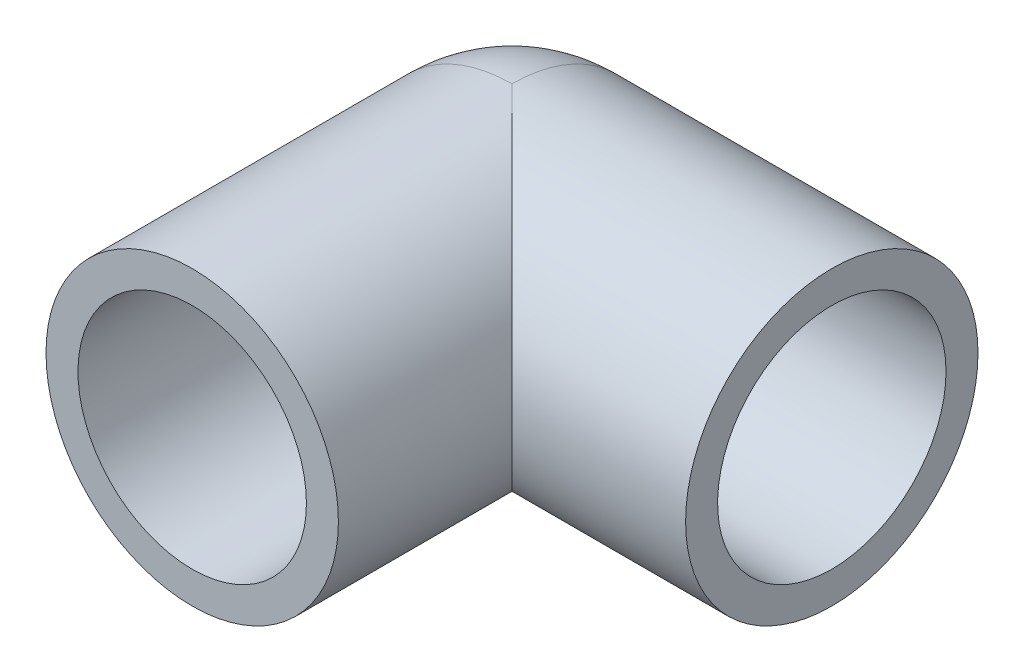
ISO-10303-21;
HEADER;
FILE_DESCRIPTION(('STEP AP214'),'2;1');
FILE_NAME('part.step','',(''),(''),'','','');
FILE_SCHEMA(('AUTOMOTIVE_DESIGN { 1 0 10303 214 1 1 1 1 }'));
ENDSEC;
DATA;
#1=APPLICATION_CONTEXT('core data for automotive mechanical design processes');
#2=APPLICATION_PROTOCOL_DEFINITION('international standard','automotive_design',2000,#1);
#3=PRODUCT_CONTEXT('',#1,'mechanical');
#4=PRODUCT('Part','Part','',(#3));
#5=PRODUCT_RELATED_PRODUCT_CATEGORY('part','',(#4));
#6=PRODUCT_DEFINITION_FORMATION('','',#4);
#7=PRODUCT_DEFINITION_CONTEXT('part definition',#1,'design');
#8=PRODUCT_DEFINITION('design','',#6,#7);
#9=PRODUCT_DEFINITION_SHAPE('','',#8);
#10=(LENGTH_UNIT() NAMED_UNIT(*) SI_UNIT(.MILLI.,.METRE.));
#11=(NAMED_UNIT(*) PLANE_ANGLE_UNIT() SI_UNIT($,.RADIAN.));
#12=(NAMED_UNIT(*) SI_UNIT($,.STERADIAN.) SOLID_ANGLE_UNIT());
#13=UNCERTAINTY_MEASURE_WITH_UNIT(LENGTH_MEASURE(1.E-05),#10,'distance_accuracy_value','');
#14=(GEOMETRIC_REPRESENTATION_CONTEXT(3) GLOBAL_UNCERTAINTY_ASSIGNED_CONTEXT((#13)) GLOBAL_UNIT_ASSIGNED_CONTEXT((#10,
#11,#12)) REPRESENTATION_CONTEXT('',''));
#15=CARTESIAN_POINT('',(0.,0.,0.));
#16=DIRECTION('',(0.,0.,1.));
#17=DIRECTION('',(1.,0.,0.));
#18=AXIS2_PLACEMENT_3D('',#15,#16,#17);
#19=CARTESIAN_POINT('',(0.,0.,35.));
#20=DIRECTION('',(0.,0.,-1.));
#21=DIRECTION('',(-1.,0.,0.));
#22=AXIS2_PLACEMENT_3D('',#19,#20,#21);
#23=CYLINDRICAL_SURFACE('',#22,16.);
#24=CARTESIAN_POINT('',(0.,0.,35.));
#25=DIRECTION('',(0.,0.,1.));
#26=DIRECTION('',(1.,0.,0.));
#27=AXIS2_PLACEMENT_3D('',#24,#25,#26);
#28=CIRCLE('',#27,16.);
#29=CARTESIAN_POINT('',(16.,0.,35.));
#30=VERTEX_POINT('',#29);
#31=EDGE_CURVE('E93',#30,#30,#28,.T.);
#32=ORIENTED_EDGE('',*,*,#31,.F.);
#33=EDGE_LOOP('',(#32));
#34=FACE_BOUND('',#33,.T.);
#35=CARTESIAN_POINT('',(0.,0.,0.));
#36=DIRECTION('',(0.707106781186547,0.,-0.707106781186547));
#37=DIRECTION('',(-0.707106781186547,0.,-0.707106781186547));
#38=AXIS2_PLACEMENT_3D('',#35,#36,#37);
#39=ELLIPSE('',#38,22.6274169979695,16.);
#40=CARTESIAN_POINT('',(0.,16.,0.));
#41=VERTEX_POINT('',#40);
#42=CARTESIAN_POINT('',(0.,-16.,0.));
#43=VERTEX_POINT('',#42);
#44=EDGE_CURVE('E92',#41,#43,#39,.T.);
#45=ORIENTED_EDGE('',*,*,#44,.F.);
#46=CARTESIAN_POINT('',(0.,0.,0.));
#47=DIRECTION('',(0.,0.,1.));
#48=DIRECTION('',(1.,0.,0.));
#49=AXIS2_PLACEMENT_3D('',#46,#47,#48);
#50=CIRCLE('',#49,16.);
#51=EDGE_CURVE('E84',#41,#43,#50,.T.);
#52=ORIENTED_EDGE('',*,*,#51,.T.);
#53=EDGE_LOOP('',(#45,#52));
#54=FACE_BOUND('',#53,.T.);
#55=ADVANCED_FACE('F35',(#34,#54),#23,.T.);
#56=CARTESIAN_POINT('',(0.,0.,35.));
#57=DIRECTION('',(0.,0.,-1.));
#58=DIRECTION('',(-1.,0.,0.));
#59=AXIS2_PLACEMENT_3D('',#56,#57,#58);
#60=CYLINDRICAL_SURFACE('',#59,12.5);
#61=CARTESIAN_POINT('',(0.,0.,35.));
#62=DIRECTION('',(0.,0.,1.));
#63=DIRECTION('',(1.,0.,0.));
#64=AXIS2_PLACEMENT_3D('',#61,#62,#63);
#65=CIRCLE('',#64,12.5);
#66=CARTESIAN_POINT('',(12.5,0.,35.));
#67=VERTEX_POINT('',#66);
#68=EDGE_CURVE('E112',#67,#67,#65,.T.);
#69=ORIENTED_EDGE('',*,*,#68,.T.);
#70=EDGE_LOOP('',(#69));
#71=FACE_BOUND('',#70,.T.);
#72=DIRECTION('',(0.,0.,-1.));
#73=VECTOR('',#72,1.);
#74=CARTESIAN_POINT('',(0.,12.5,35.));
#75=LINE('',#74,#73);
#76=CARTESIAN_POINT('',(0.,12.5,0.));
#77=VERTEX_POINT('',#76);
#78=CARTESIAN_POINT('',(0.,12.5,9.98749217771909));
#79=VERTEX_POINT('',#78);
#80=EDGE_CURVE('E122',#77,#79,#75,.F.);
#81=ORIENTED_EDGE('',*,*,#80,.T.);
#82=CARTESIAN_POINT('',(0.,12.5,9.98749217771909));
#83=CARTESIAN_POINT('',(0.144765939258269,12.5000039713035,9.9874792375071));
#84=CARTESIAN_POINT('',(0.289500768758806,12.4974842219506,9.99064164597223));
#85=CARTESIAN_POINT('',(0.578496388531646,12.4874428530207,10.0031928812679));
#86=CARTESIAN_POINT('',(0.722757272903658,12.4799222952672,10.0125803863203));
#87=CARTESIAN_POINT('',(1.15346240868712,12.4499846032809,10.0498235033874));
#88=CARTESIAN_POINT('',(1.43868016846623,12.4201908621868,10.086761191272));
#89=CARTESIAN_POINT('',(1.99838143732547,12.3424144689702,10.1817705778644));
#90=CARTESIAN_POINT('',(2.27296204134154,12.2947136259312,10.2395143074388));
#91=CARTESIAN_POINT('',(2.8142411856663,12.1822217089497,10.3730943724714));
#92=CARTESIAN_POINT('',(3.08093393454397,12.1174184082355,10.4489436481017));
#93=CARTESIAN_POINT('',(3.66587879723391,11.9550657753382,10.634607832145));
#94=CARTESIAN_POINT('',(3.98177716623853,11.8534088032738,10.7482208979897));
#95=CARTESIAN_POINT('',(4.59892316278278,11.6278940118057,10.9917979176121));
#96=CARTESIAN_POINT('',(4.90016766189858,11.5040314779987,11.1217653417897));
#97=CARTESIAN_POINT('',(5.4897150239081,11.2347095097614,11.3937772832068));
#98=CARTESIAN_POINT('',(5.77792676334296,11.0891217721173,11.535891246081));
#99=CARTESIAN_POINT('',(6.33950858826032,10.7779255937651,11.8271616260655));
#100=CARTESIAN_POINT('',(6.61287986056642,10.6123187574545,11.9763174782319));
#101=CARTESIAN_POINT('',(7.15178768157901,10.2571325058059,12.282001520992));
#102=CARTESIAN_POINT('',(7.41693488086361,10.0670411636648,12.4386205480631));
#103=CARTESIAN_POINT('',(7.93149504051984,9.66683070553962,12.7521376989664));
#104=CARTESIAN_POINT('',(8.18090746714291,9.45671091076489,12.909035832081));
#105=CARTESIAN_POINT('',(8.66300567572775,9.0171243831435,13.2198257919539));
#106=CARTESIAN_POINT('',(8.89572270172659,8.7876956327564,13.3737228197949));
#107=CARTESIAN_POINT('',(9.34408100362736,8.30936729608235,13.6760542441486));
#108=CARTESIAN_POINT('',(9.55972331331234,8.06046889039586,13.8244889710827));
#109=CARTESIAN_POINT('',(9.96348044291906,7.55505976650153,14.1067737967742));
#110=CARTESIAN_POINT('',(10.1523952110983,7.29938788073774,14.2409792968047));
#111=CARTESIAN_POINT('',(10.5121729040342,6.77099323074985,14.4996604904861));
#112=CARTESIAN_POINT('',(10.6830382089783,6.49827272230116,14.6241374664755));
#113=CARTESIAN_POINT('',(11.0050875858175,5.9365654161209,14.8610249120178));
#114=CARTESIAN_POINT('',(11.156278832046,5.64758460323973,14.9734397774965));
#115=CARTESIAN_POINT('',(11.4372550959724,5.05438832992194,15.1839436527159));
#116=CARTESIAN_POINT('',(11.5670437810643,4.7501754912099,15.2820351164844));
#117=CARTESIAN_POINT('',(11.7851804238597,4.17597912731154,15.4478563972793));
#118=CARTESIAN_POINT('',(11.876831858331,3.90792600784162,15.5179355333653));
#119=CARTESIAN_POINT('',(12.0423676196806,3.36338036329094,15.6449928218223));
#120=CARTESIAN_POINT('',(12.1162552003071,3.08688939421571,15.7019733733349));
#121=CARTESIAN_POINT('',(12.2452371994632,2.52717224661567,15.8017139021477));
#122=CARTESIAN_POINT('',(12.300340890901,2.24394946542267,15.8444808958915));
#123=CARTESIAN_POINT('',(12.3909787621484,1.6725200915697,15.9149470934331));
#124=CARTESIAN_POINT('',(12.4265127222875,1.38431344300321,15.942646128093));
#125=CARTESIAN_POINT('',(12.4775157847035,0.804148322051992,15.9824323505704));
#126=CARTESIAN_POINT('',(12.4929225558123,0.51218100918579,15.9944710399407));
#127=CARTESIAN_POINT('',(12.5032079106027,-0.0723381895796762,16.0025059781158));
#128=CARTESIAN_POINT('',(12.498086451029,-0.364890076709409,15.9985021931173));
#129=CARTESIAN_POINT('',(12.4674010437957,-0.948287046326773,15.9745421702461));
#130=CARTESIAN_POINT('',(12.441834940023,-1.23913194553466,15.9545842498341));
#131=CARTESIAN_POINT('',(12.3706812842126,-1.81685212217066,15.899159036913));
#132=CARTESIAN_POINT('',(12.3250940522936,-2.10372746299256,15.86369199238));
#133=CARTESIAN_POINT('',(12.2171573641478,-2.65842227512138,15.7799819673798));
#134=CARTESIAN_POINT('',(12.1556741611659,-2.92651173240639,15.7324007549696));
#135=CARTESIAN_POINT('',(12.0159531165259,-3.45568496999959,15.6246967709757));
#136=CARTESIAN_POINT('',(11.9377159190807,-3.71676901924065,15.5645744816152));
#137=CARTESIAN_POINT('',(11.7654161700808,-4.23065378130327,15.4328200996928));
#138=CARTESIAN_POINT('',(11.6713537656552,-4.4834545711094,15.3611881141386));
#139=CARTESIAN_POINT('',(11.4683544362756,-4.97983789756668,15.2075229426086));
#140=CARTESIAN_POINT('',(11.3594120884665,-5.22341703194712,15.1254859654135));
#141=CARTESIAN_POINT('',(11.1157303599794,-5.72504023968639,14.943301245629));
#142=CARTESIAN_POINT('',(10.9794899633515,-5.98199334885024,14.842158536431));
#143=CARTESIAN_POINT('',(10.6913468975092,-6.4829506854815,14.6302891095967));
#144=CARTESIAN_POINT('',(10.5394377149198,-6.7269494635907,14.5195584094129));
#145=CARTESIAN_POINT('',(10.2210905998917,-7.20145547388481,14.2901541196085));
#146=CARTESIAN_POINT('',(10.0546482276095,-7.43195854699469,14.1714781053205));
#147=CARTESIAN_POINT('',(9.70831036964397,-7.87900051778326,13.927890793563));
#148=CARTESIAN_POINT('',(9.52841816290131,-8.09554279515161,13.8029810182779));
#149=CARTESIAN_POINT('',(9.11792625293418,-8.55729830916146,13.5225633798666));
#150=CARTESIAN_POINT('',(8.88447009576638,-8.79934490296252,13.3660130814476));
#151=CARTESIAN_POINT('',(8.40020433766377,-9.26277096815218,13.049133525471));
#152=CARTESIAN_POINT('',(8.14939166441938,-9.48414676418715,12.8888036022038));
#153=CARTESIAN_POINT('',(7.63064594301947,-9.90632547082447,12.567228820053));
#154=CARTESIAN_POINT('',(7.36268307750842,-10.1070908789,12.4059828376629));
#155=CARTESIAN_POINT('',(6.81037591670874,-10.4871898502785,12.0863751803195));
#156=CARTESIAN_POINT('',(6.5260341898327,-10.6665267603545,11.9280130582389));
#157=CARTESIAN_POINT('',(5.98481380594213,-10.9779008293737,11.6414570646984));
#158=CARTESIAN_POINT('',(5.73020517456384,-11.1129987895535,11.5122986456666));
#159=CARTESIAN_POINT('',(5.20902214604569,-11.3666209943456,11.2619564327387));
#160=CARTESIAN_POINT('',(4.94244752027508,-11.4851449221045,11.1407727913235));
#161=CARTESIAN_POINT('',(4.39884389627542,-11.7040826925897,10.9105247522671));
#162=CARTESIAN_POINT('',(4.12188133261541,-11.8045936478164,10.8013966636955));
#163=CARTESIAN_POINT('',(3.5564070319716,-11.987083212473,10.598512500232));
#164=CARTESIAN_POINT('',(3.26789783767151,-12.0690658758741,10.5047530639306));
#165=CARTESIAN_POINT('',(2.73826613141618,-12.1988050653855,10.3536003368885));
#166=CARTESIAN_POINT('',(2.49902537525858,-12.2501230530087,10.292681808935));
#167=CARTESIAN_POINT('',(2.01477142374001,-12.3390135419168,10.1859500180524));
#168=CARTESIAN_POINT('',(1.76976115468981,-12.3765928581904,10.1401292670747));
#169=CARTESIAN_POINT('',(1.27208965311822,-12.4376601532868,10.0651385806626));
#170=CARTESIAN_POINT('',(1.01937043176317,-12.4609593737819,10.0361919260033));
#171=CARTESIAN_POINT('',(0.638333471263218,-12.4843420662299,10.0070644917871));
#172=CARTESIAN_POINT('',(0.510864658253595,-12.4902086680948,9.99973728452525));
#173=CARTESIAN_POINT('',(0.255604354712135,-12.4980390746827,9.98994692418026));
#174=CARTESIAN_POINT('',(0.127812823775837,-12.5000023637012,9.98748441381945));
#175=CARTESIAN_POINT('',(0.,-12.5,9.98749217771921));
#176=B_SPLINE_CURVE_WITH_KNOTS('',3,(#82,#83,#84,#85,#86,#87,#88,#89,#90,#91,#92,#93,#94,#95,
#96,#97,#98,#99,#100,#101,#102,#103,#104,#105,#106,#107,#108,#109,#110,#111,#112,#113,#114,#115,
#116,#117,#118,#119,#120,#121,#122,#123,#124,#125,#126,#127,#128,#129,#130,#131,#132,#133,#134,
#135,#136,#137,#138,#139,#140,#141,#142,#143,#144,#145,#146,#147,#148,#149,#150,#151,#152,#153,
#154,#155,#156,#157,#158,#159,#160,#161,#162,#163,#164,#165,#166,#167,#168,#169,#170,#171,#172,
#173,#174,#175),.UNSPECIFIED.,.F.,.F.,(4,2,2,2,2,2,2,2,2,2,2,2,2,2,2,2,2,2,2,2,2,2,2,2,2,2,2,2,
2,2,2,2,2,2,2,2,2,2,2,2,2,2,2,2,2,2,4),(0.,0.434181679016579,0.86827119750537,1.73391116185585,
2.58646349016976,3.43962697822759,4.49026308996789,5.54112252416605,6.59845349035484,
7.65569977460251,8.7404750846385,9.82528717221699,10.9080130967421,11.9906734177792,
13.0248938601342,14.0589777488613,15.0926834859387,16.1262119099242,17.0008029985086,
17.87523376879,18.7492322378148,19.6232405172795,20.4999491150294,21.37665956011,
22.2534624761704,23.1302513735011,23.9667611934174,24.8032388542103,25.6397087385786,
26.4764842839669,27.3993708526656,28.3226426151419,29.2461974277178,30.1695278160733,
31.2812778538504,32.3932251904797,33.5071612344747,34.6209230722451,35.5677786973426,
36.5146524214408,37.4562567666843,38.3976548899784,39.1533113794086,39.9085925195615,
40.673653214973,41.056961032835,41.4403194898288),.UNSPECIFIED.);
#177=CARTESIAN_POINT('',(0.,-12.5,9.98749217771909));
#178=VERTEX_POINT('',#177);
#179=EDGE_CURVE('E11',#79,#178,#176,.T.);
#180=ORIENTED_EDGE('',*,*,#179,.T.);
#181=DIRECTION('',(0.,0.,-1.));
#182=VECTOR('',#181,1.);
#183=CARTESIAN_POINT('',(0.,-12.5,35.));
#184=LINE('',#183,#182);
#185=CARTESIAN_POINT('',(0.,-12.5,0.));
#186=VERTEX_POINT('',#185);
#187=EDGE_CURVE('E50',#178,#186,#184,.T.);
#188=ORIENTED_EDGE('',*,*,#187,.T.);
#189=CARTESIAN_POINT('',(0.,0.,0.));
#190=DIRECTION('',(0.,0.,1.));
#191=DIRECTION('',(1.,0.,0.));
#192=AXIS2_PLACEMENT_3D('',#189,#190,#191);
#193=CIRCLE('',#192,12.5);
#194=EDGE_CURVE('E101',#77,#186,#193,.T.);
#195=ORIENTED_EDGE('',*,*,#194,.F.);
#196=EDGE_LOOP('',(#81,#180,#188,#195));
#197=FACE_BOUND('',#196,.T.);
#198=ADVANCED_FACE('F127',(#71,#197),#60,.F.);
#199=CARTESIAN_POINT('',(0.,0.,35.));
#200=DIRECTION('',(0.,0.,1.));
#201=DIRECTION('',(1.,0.,0.));
#202=AXIS2_PLACEMENT_3D('',#199,#200,#201);
#203=PLANE('',#202);
#204=ORIENTED_EDGE('',*,*,#31,.T.);
#205=EDGE_LOOP('',(#204));
#206=FACE_BOUND('',#205,.T.);
#207=ORIENTED_EDGE('',*,*,#68,.F.);
#208=EDGE_LOOP('',(#207));
#209=FACE_BOUND('',#208,.T.);
#210=ADVANCED_FACE('F176',(#206,#209),#203,.T.);
#211=CARTESIAN_POINT('',(35.,0.,0.));
#212=DIRECTION('',(-1.,0.,0.));
#213=DIRECTION('',(0.,0.,1.));
#214=AXIS2_PLACEMENT_3D('',#211,#212,#213);
#215=CYLINDRICAL_SURFACE('',#214,12.5);
#216=CARTESIAN_POINT('',(0.,0.,0.));
#217=DIRECTION('',(1.,0.,0.));
#218=DIRECTION('',(0.,0.,-1.));
#219=AXIS2_PLACEMENT_3D('',#216,#217,#218);
#220=CIRCLE('',#219,12.5);
#221=EDGE_CURVE('E144',#77,#186,#220,.T.);
#222=ORIENTED_EDGE('',*,*,#221,.F.);
#223=CARTESIAN_POINT('',(0.,0.,0.));
#224=DIRECTION('',(0.707106781186547,0.,-0.707106781186547));
#225=DIRECTION('',(-0.707106781186547,0.,-0.707106781186547));
#226=AXIS2_PLACEMENT_3D('',#223,#224,#225);
#227=ELLIPSE('',#226,17.6776695296637,12.5);
#228=EDGE_CURVE('E117',#77,#186,#227,.T.);
#229=ORIENTED_EDGE('',*,*,#228,.T.);
#230=EDGE_LOOP('',(#222,#229));
#231=FACE_BOUND('',#230,.T.);
#232=ADVANCED_FACE('F143',(#231),#215,.F.);
#233=CARTESIAN_POINT('',(35.,0.,0.));
#234=DIRECTION('',(-1.,0.,0.));
#235=DIRECTION('',(0.,0.,1.));
#236=AXIS2_PLACEMENT_3D('',#233,#234,#235);
#237=CYLINDRICAL_SURFACE('',#236,16.);
#238=ORIENTED_EDGE('',*,*,#179,.F.);
#239=CARTESIAN_POINT('',(0.,0.,0.));
#240=DIRECTION('',(1.,0.,0.));
#241=DIRECTION('',(0.,0.,-1.));
#242=AXIS2_PLACEMENT_3D('',#239,#240,#241);
#243=CIRCLE('',#242,16.);
#244=EDGE_CURVE('E88',#79,#178,#243,.T.);
#245=ORIENTED_EDGE('',*,*,#244,.T.);
#246=EDGE_LOOP('',(#238,#245));
#247=FACE_BOUND('',#246,.T.);
#248=ADVANCED_FACE('F172',(#247),#237,.T.);
#249=CARTESIAN_POINT('',(0.,0.,0.));
#250=DIRECTION('',(1.,0.,0.));
#251=DIRECTION('',(0.,0.,-1.));
#252=AXIS2_PLACEMENT_3D('',#249,#250,#251);
#253=PLANE('',#252);
#254=ORIENTED_EDGE('',*,*,#187,.F.);
#255=ORIENTED_EDGE('',*,*,#244,.F.);
#256=ORIENTED_EDGE('',*,*,#80,.F.);
#257=ORIENTED_EDGE('',*,*,#221,.T.);
#258=EDGE_LOOP('',(#254,#255,#256,#257));
#259=FACE_BOUND('',#258,.T.);
#260=ADVANCED_FACE('F146',(#259),#253,.F.);
#261=CARTESIAN_POINT('',(9.98749217771909,-12.5,0.));
#262=VERTEX_POINT('',#261);
#263=CARTESIAN_POINT('',(9.98749217771909,12.5,0.));
#264=VERTEX_POINT('',#263);
#265=EDGE_CURVE('E94',#262,#264,#50,.T.);
#266=ORIENTED_EDGE('',*,*,#265,.T.);
#267=CARTESIAN_POINT('',(9.98749217771909,12.5,0.));
#268=CARTESIAN_POINT('',(9.9874792375071,12.5000039713035,0.144765939258269));
#269=CARTESIAN_POINT('',(9.99064164597223,12.4974842219506,0.289500768758806));
#270=CARTESIAN_POINT('',(10.0031928812679,12.4874428530207,0.578496388531646));
#271=CARTESIAN_POINT('',(10.0125803863203,12.4799222952672,0.722757272903658));
#272=CARTESIAN_POINT('',(10.0498235033874,12.4499846032809,1.15346240868712));
#273=CARTESIAN_POINT('',(10.086761191272,12.4201908621868,1.43868016846623));
#274=CARTESIAN_POINT('',(10.1817705778644,12.3424144689702,1.99838143732547));
#275=CARTESIAN_POINT('',(10.2395143074388,12.2947136259312,2.27296204134154));
#276=CARTESIAN_POINT('',(10.3730943724714,12.1822217089497,2.8142411856663));
#277=CARTESIAN_POINT('',(10.4489436481017,12.1174184082355,3.08093393454397));
#278=CARTESIAN_POINT('',(10.634607832145,11.9550657753382,3.66587879723391));
#279=CARTESIAN_POINT('',(10.7482208979897,11.8534088032738,3.98177716623853));
#280=CARTESIAN_POINT('',(10.9917979176121,11.6278940118057,4.59892316278278));
#281=CARTESIAN_POINT('',(11.1217653417897,11.5040314779987,4.90016766189858));
#282=CARTESIAN_POINT('',(11.3937772832068,11.2347095097614,5.4897150239081));
#283=CARTESIAN_POINT('',(11.535891246081,11.0891217721173,5.77792676334296));
#284=CARTESIAN_POINT('',(11.8271616260655,10.7779255937651,6.33950858826032));
#285=CARTESIAN_POINT('',(11.9763174782319,10.6123187574545,6.61287986056642));
#286=CARTESIAN_POINT('',(12.282001520992,10.2571325058059,7.15178768157901));
#287=CARTESIAN_POINT('',(12.4386205480631,10.0670411636648,7.41693488086361));
#288=CARTESIAN_POINT('',(12.7521376989664,9.66683070553962,7.93149504051984));
#289=CARTESIAN_POINT('',(12.909035832081,9.45671091076489,8.18090746714291));
#290=CARTESIAN_POINT('',(13.2198257919539,9.0171243831435,8.66300567572775));
#291=CARTESIAN_POINT('',(13.3737228197949,8.7876956327564,8.89572270172659));
#292=CARTESIAN_POINT('',(13.6760542441486,8.30936729608235,9.34408100362736));
#293=CARTESIAN_POINT('',(13.8244889710827,8.06046889039585,9.55972331331234));
#294=CARTESIAN_POINT('',(14.1067737967742,7.55505976650153,9.96348044291906));
#295=CARTESIAN_POINT('',(14.2409792968047,7.29938788073774,10.1523952110983));
#296=CARTESIAN_POINT('',(14.4996604904861,6.77099323074985,10.5121729040342));
#297=CARTESIAN_POINT('',(14.6241374664755,6.49827272230116,10.6830382089783));
#298=CARTESIAN_POINT('',(14.8610249120178,5.9365654161209,11.0050875858175));
#299=CARTESIAN_POINT('',(14.9734397774965,5.64758460323973,11.156278832046));
#300=CARTESIAN_POINT('',(15.1839436527159,5.05438832992194,11.4372550959724));
#301=CARTESIAN_POINT('',(15.2820351164844,4.7501754912099,11.5670437810643));
#302=CARTESIAN_POINT('',(15.4478563972793,4.17597912731154,11.7851804238597));
#303=CARTESIAN_POINT('',(15.5179355333653,3.90792600784162,11.876831858331));
#304=CARTESIAN_POINT('',(15.6449928218223,3.36338036329094,12.0423676196806));
#305=CARTESIAN_POINT('',(15.7019733733349,3.08688939421571,12.1162552003071));
#306=CARTESIAN_POINT('',(15.8017139021477,2.52717224661567,12.2452371994632));
#307=CARTESIAN_POINT('',(15.8444808958915,2.24394946542267,12.300340890901));
#308=CARTESIAN_POINT('',(15.9149470934331,1.6725200915697,12.3909787621484));
#309=CARTESIAN_POINT('',(15.942646128093,1.38431344300321,12.4265127222875));
#310=CARTESIAN_POINT('',(15.9824323505704,0.804148322051991,12.4775157847035));
#311=CARTESIAN_POINT('',(15.9944710399407,0.512181009185787,12.4929225558123));
#312=CARTESIAN_POINT('',(16.0025059781158,-0.0723381895796799,12.5032079106027));
#313=CARTESIAN_POINT('',(15.9985021931173,-0.364890076709413,12.498086451029));
#314=CARTESIAN_POINT('',(15.9745421702461,-0.948287046326775,12.4674010437957));
#315=CARTESIAN_POINT('',(15.9545842498341,-1.23913194553466,12.441834940023));
#316=CARTESIAN_POINT('',(15.899159036913,-1.81685212217066,12.3706812842126));
#317=CARTESIAN_POINT('',(15.86369199238,-2.10372746299256,12.3250940522936));
#318=CARTESIAN_POINT('',(15.7799819673798,-2.65842227512139,12.2171573641478));
#319=CARTESIAN_POINT('',(15.7324007549696,-2.92651173240639,12.1556741611659));
#320=CARTESIAN_POINT('',(15.6246967709757,-3.45568496999959,12.0159531165259));
#321=CARTESIAN_POINT('',(15.5645744816152,-3.71676901924065,11.9377159190807));
#322=CARTESIAN_POINT('',(15.4328200996928,-4.23065378130327,11.7654161700808));
#323=CARTESIAN_POINT('',(15.3611881141386,-4.4834545711094,11.6713537656552));
#324=CARTESIAN_POINT('',(15.2075229426086,-4.97983789756668,11.4683544362756));
#325=CARTESIAN_POINT('',(15.1254859654135,-5.22341703194713,11.3594120884665));
#326=CARTESIAN_POINT('',(14.943301245629,-5.72504023968639,11.1157303599794));
#327=CARTESIAN_POINT('',(14.842158536431,-5.98199334885024,10.9794899633515));
#328=CARTESIAN_POINT('',(14.6302891095967,-6.4829506854815,10.6913468975092));
#329=CARTESIAN_POINT('',(14.5195584094129,-6.7269494635907,10.5394377149198));
#330=CARTESIAN_POINT('',(14.2901541196085,-7.20145547388482,10.2210905998917));
#331=CARTESIAN_POINT('',(14.1714781053205,-7.43195854699469,10.0546482276095));
#332=CARTESIAN_POINT('',(13.927890793563,-7.87900051778326,9.70831036964397));
#333=CARTESIAN_POINT('',(13.8029810182779,-8.09554279515161,9.52841816290131));
#334=CARTESIAN_POINT('',(13.5225633798666,-8.55729830916146,9.11792625293418));
#335=CARTESIAN_POINT('',(13.3660130814476,-8.79934490296252,8.88447009576638));
#336=CARTESIAN_POINT('',(13.049133525471,-9.26277096815218,8.40020433766377));
#337=CARTESIAN_POINT('',(12.8888036022038,-9.48414676418716,8.14939166441937));
#338=CARTESIAN_POINT('',(12.567228820053,-9.90632547082447,7.63064594301947));
#339=CARTESIAN_POINT('',(12.4059828376629,-10.1070908789,7.36268307750842));
#340=CARTESIAN_POINT('',(12.0863751803195,-10.4871898502785,6.81037591670874));
#341=CARTESIAN_POINT('',(11.9280130582389,-10.6665267603545,6.5260341898327));
#342=CARTESIAN_POINT('',(11.6414570646984,-10.9779008293737,5.98481380594212));
#343=CARTESIAN_POINT('',(11.5122986456666,-11.1129987895535,5.73020517456383));
#344=CARTESIAN_POINT('',(11.2619564327387,-11.3666209943456,5.20902214604569));
#345=CARTESIAN_POINT('',(11.1407727913235,-11.4851449221045,4.94244752027508));
#346=CARTESIAN_POINT('',(10.9105247522671,-11.7040826925897,4.39884389627542));
#347=CARTESIAN_POINT('',(10.8013966636955,-11.8045936478164,4.12188133261541));
#348=CARTESIAN_POINT('',(10.598512500232,-11.987083212473,3.5564070319716));
#349=CARTESIAN_POINT('',(10.5047530639306,-12.0690658758741,3.2678978376715));
#350=CARTESIAN_POINT('',(10.3536003368885,-12.1988050653855,2.73826613141618));
#351=CARTESIAN_POINT('',(10.292681808935,-12.2501230530087,2.49902537525857));
#352=CARTESIAN_POINT('',(10.1859500180524,-12.3390135419168,2.01477142374001));
#353=CARTESIAN_POINT('',(10.1401292670747,-12.3765928581904,1.76976115468981));
#354=CARTESIAN_POINT('',(10.0651385806626,-12.4376601532868,1.27208965311821));
#355=CARTESIAN_POINT('',(10.0361919260034,-12.4609593737819,1.01937043176316));
#356=CARTESIAN_POINT('',(10.0070644917871,-12.4843420662299,0.638333471263216));
#357=CARTESIAN_POINT('',(9.99973728452525,-12.4902086680948,0.510864658253593));
#358=CARTESIAN_POINT('',(9.98994692418026,-12.4980390746827,0.255604354712134));
#359=CARTESIAN_POINT('',(9.98748441381944,-12.5000023637012,0.127812823775837));
#360=CARTESIAN_POINT('',(9.98749217771921,-12.5,0.));
#361=B_SPLINE_CURVE_WITH_KNOTS('',3,(#267,#268,#269,#270,#271,#272,#273,#274,#275,#276,#277,
#278,#279,#280,#281,#282,#283,#284,#285,#286,#287,#288,#289,#290,#291,#292,#293,#294,#295,#296,
#297,#298,#299,#300,#301,#302,#303,#304,#305,#306,#307,#308,#309,#310,#311,#312,#313,#314,#315,
#316,#317,#318,#319,#320,#321,#322,#323,#324,#325,#326,#327,#328,#329,#330,#331,#332,#333,#334,
#335,#336,#337,#338,#339,#340,#341,#342,#343,#344,#345,#346,#347,#348,#349,#350,#351,#352,#353,
#354,#355,#356,#357,#358,#359,#360),.UNSPECIFIED.,.F.,.F.,(4,2,2,2,2,2,2,2,2,2,2,2,2,2,2,2,2,2,
2,2,2,2,2,2,2,2,2,2,2,2,2,2,2,2,2,2,2,2,2,2,2,2,2,2,2,2,4),(0.,0.434181679016579,
0.86827119750537,1.73391116185585,2.58646349016976,3.43962697822759,4.49026308996789,
5.54112252416605,6.59845349035484,7.65569977460251,8.7404750846385,9.82528717221699,
10.9080130967421,11.9906734177792,13.0248938601342,14.0589777488613,15.0926834859387,
16.1262119099242,17.0008029985086,17.87523376879,18.7492322378148,19.6232405172795,
20.4999491150294,21.37665956011,22.2534624761704,23.1302513735011,23.9667611934174,
24.8032388542103,25.6397087385786,26.4764842839669,27.3993708526656,28.3226426151419,
29.2461974277178,30.1695278160733,31.2812778538504,32.3932251904797,33.5071612344747,
34.6209230722451,35.5677786973426,36.5146524214408,37.4562567666843,38.3976548899784,
39.1533113794086,39.9085925195615,40.673653214973,41.056961032835,41.4403194898288),.UNSPECIFIED.);
#362=EDGE_CURVE('E98',#264,#262,#361,.T.);
#363=ORIENTED_EDGE('',*,*,#362,.T.);
#364=EDGE_LOOP('',(#266,#363));
#365=FACE_BOUND('',#364,.T.);
#366=ADVANCED_FACE('F37',(#365),#23,.T.);
#367=ORIENTED_EDGE('',*,*,#228,.F.);
#368=EDGE_CURVE('E97',#186,#77,#193,.T.);
#369=ORIENTED_EDGE('',*,*,#368,.F.);
#370=EDGE_LOOP('',(#367,#369));
#371=FACE_BOUND('',#370,.T.);
#372=ADVANCED_FACE('F135',(#371),#60,.F.);
#373=CARTESIAN_POINT('',(0.,0.,0.));
#374=DIRECTION('',(0.,0.,1.));
#375=DIRECTION('',(1.,0.,0.));
#376=AXIS2_PLACEMENT_3D('',#373,#374,#375);
#377=PLANE('',#376);
#378=ORIENTED_EDGE('',*,*,#368,.T.);
#379=DIRECTION('',(-1.,0.,0.));
#380=VECTOR('',#379,1.);
#381=CARTESIAN_POINT('',(35.,12.5,0.));
#382=LINE('',#381,#380);
#383=EDGE_CURVE('E103',#77,#264,#382,.F.);
#384=ORIENTED_EDGE('',*,*,#383,.T.);
#385=ORIENTED_EDGE('',*,*,#265,.F.);
#386=DIRECTION('',(-1.,0.,0.));
#387=VECTOR('',#386,1.);
#388=CARTESIAN_POINT('',(35.,-12.5,0.));
#389=LINE('',#388,#387);
#390=EDGE_CURVE('E62',#262,#186,#389,.T.);
#391=ORIENTED_EDGE('',*,*,#390,.T.);
#392=EDGE_LOOP('',(#378,#384,#385,#391));
#393=FACE_BOUND('',#392,.T.);
#394=ADVANCED_FACE('F139',(#393),#377,.F.);
#395=CARTESIAN_POINT('',(35.,0.,0.));
#396=DIRECTION('',(1.,0.,0.));
#397=DIRECTION('',(0.,0.,-1.));
#398=AXIS2_PLACEMENT_3D('',#395,#396,#397);
#399=CIRCLE('',#398,16.);
#400=CARTESIAN_POINT('',(35.,0.,-16.));
#401=VERTEX_POINT('',#400);
#402=EDGE_CURVE('E140',#401,#401,#399,.T.);
#403=ORIENTED_EDGE('',*,*,#402,.F.);
#404=EDGE_LOOP('',(#403));
#405=FACE_BOUND('',#404,.T.);
#406=EDGE_CURVE('E81',#43,#41,#243,.T.);
#407=ORIENTED_EDGE('',*,*,#406,.T.);
#408=ORIENTED_EDGE('',*,*,#44,.T.);
#409=EDGE_LOOP('',(#407,#408));
#410=FACE_BOUND('',#409,.T.);
#411=ADVANCED_FACE('F96',(#405,#410),#237,.T.);
#412=CARTESIAN_POINT('',(35.,0.,0.));
#413=DIRECTION('',(1.,0.,0.));
#414=DIRECTION('',(0.,0.,-1.));
#415=AXIS2_PLACEMENT_3D('',#412,#413,#414);
#416=CIRCLE('',#415,12.5);
#417=CARTESIAN_POINT('',(35.,0.,-12.5));
#418=VERTEX_POINT('',#417);
#419=EDGE_CURVE('E89',#418,#418,#416,.T.);
#420=ORIENTED_EDGE('',*,*,#419,.T.);
#421=EDGE_LOOP('',(#420));
#422=FACE_BOUND('',#421,.T.);
#423=ORIENTED_EDGE('',*,*,#362,.F.);
#424=ORIENTED_EDGE('',*,*,#383,.F.);
#425=EDGE_CURVE('E57',#186,#77,#220,.T.);
#426=ORIENTED_EDGE('',*,*,#425,.F.);
#427=ORIENTED_EDGE('',*,*,#390,.F.);
#428=EDGE_LOOP('',(#423,#424,#426,#427));
#429=FACE_BOUND('',#428,.T.);
#430=ADVANCED_FACE('F161',(#422,#429),#215,.F.);
#431=CARTESIAN_POINT('',(35.,0.,0.));
#432=DIRECTION('',(1.,0.,0.));
#433=DIRECTION('',(0.,0.,-1.));
#434=AXIS2_PLACEMENT_3D('',#431,#432,#433);
#435=PLANE('',#434);
#436=ORIENTED_EDGE('',*,*,#402,.T.);
#437=EDGE_LOOP('',(#436));
#438=FACE_BOUND('',#437,.T.);
#439=ORIENTED_EDGE('',*,*,#419,.F.);
#440=EDGE_LOOP('',(#439));
#441=FACE_BOUND('',#440,.T.);
#442=ADVANCED_FACE('F163',(#438,#441),#435,.T.);
#443=CARTESIAN_POINT('',(0.,0.,0.));
#444=DIRECTION('',(-1.,0.,0.));
#445=DIRECTION('',(0.,0.,1.));
#446=AXIS2_PLACEMENT_3D('',#443,#444,#445);
#447=PLANE('',#446);
#448=ORIENTED_EDGE('',*,*,#425,.T.);
#449=DIRECTION('',(0.,1.,0.));
#450=VECTOR('',#449,1.);
#451=CARTESIAN_POINT('',(0.,16.,0.));
#452=LINE('',#451,#450);
#453=EDGE_CURVE('E152',#186,#77,#452,.T.);
#454=ORIENTED_EDGE('',*,*,#453,.F.);
#455=EDGE_LOOP('',(#448,#454));
#456=FACE_BOUND('',#455,.T.);
#457=ADVANCED_FACE('F154',(#456),#447,.F.);
#458=CARTESIAN_POINT('',(0.,0.,0.));
#459=DIRECTION('',(0.,0.,1.));
#460=DIRECTION('',(1.,0.,0.));
#461=AXIS2_PLACEMENT_3D('',#458,#459,#460);
#462=PLANE('',#461);
#463=ORIENTED_EDGE('',*,*,#453,.T.);
#464=ORIENTED_EDGE('',*,*,#194,.T.);
#465=EDGE_LOOP('',(#463,#464));
#466=FACE_BOUND('',#465,.T.);
#467=ADVANCED_FACE('F151',(#466),#462,.T.);
#468=CARTESIAN_POINT('',(0.,0.,0.));
#469=DIRECTION('',(0.,1.,0.));
#470=DIRECTION('',(0.,0.,1.));
#471=AXIS2_PLACEMENT_3D('',#468,#469,#470);
#472=SPHERICAL_SURFACE('',#471,16.);
#473=ORIENTED_EDGE('',*,*,#51,.F.);
#474=ORIENTED_EDGE('',*,*,#406,.F.);
#475=EDGE_LOOP('',(#473,#474));
#476=FACE_BOUND('',#475,.T.);
#477=ADVANCED_FACE('F83',(#476),#472,.T.);
#478=CLOSED_SHELL('',(#55,#198,#210,#232,#248,#260,#366,#372,#394,#411,#430,#442,#457,#467,#477));
#479=MANIFOLD_SOLID_BREP('B2',#478);
#480=ADVANCED_BREP_SHAPE_REPRESENTATION('',(#18,#479),#14);
#481=SHAPE_DEFINITION_REPRESENTATION(#9,#480);
ENDSEC;
END-ISO-10303-21;
